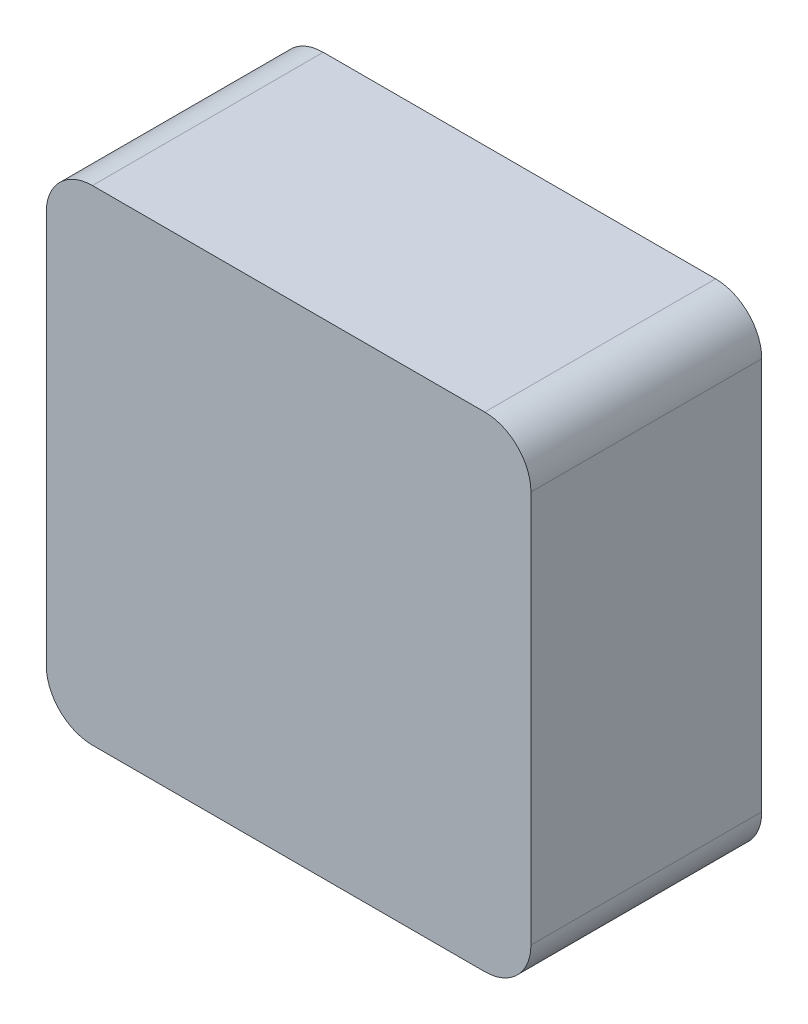
ISO-10303-21;
HEADER;
FILE_DESCRIPTION(('STEP AP214'),'2;1');
FILE_NAME('part.step','',(''),(''),'','','');
FILE_SCHEMA(('AUTOMOTIVE_DESIGN { 1 0 10303 214 1 1 1 1 }'));
ENDSEC;
DATA;
#1=APPLICATION_CONTEXT('core data for automotive mechanical design processes');
#2=APPLICATION_PROTOCOL_DEFINITION('international standard','automotive_design',2000,#1);
#3=PRODUCT_CONTEXT('',#1,'mechanical');
#4=PRODUCT('Part','Part','',(#3));
#5=PRODUCT_RELATED_PRODUCT_CATEGORY('part','',(#4));
#6=PRODUCT_DEFINITION_FORMATION('','',#4);
#7=PRODUCT_DEFINITION_CONTEXT('part definition',#1,'design');
#8=PRODUCT_DEFINITION('design','',#6,#7);
#9=PRODUCT_DEFINITION_SHAPE('','',#8);
#10=(LENGTH_UNIT() NAMED_UNIT(*) SI_UNIT(.MILLI.,.METRE.));
#11=(NAMED_UNIT(*) PLANE_ANGLE_UNIT() SI_UNIT($,.RADIAN.));
#12=(NAMED_UNIT(*) SI_UNIT($,.STERADIAN.) SOLID_ANGLE_UNIT());
#13=UNCERTAINTY_MEASURE_WITH_UNIT(LENGTH_MEASURE(1.E-05),#10,'distance_accuracy_value','');
#14=(GEOMETRIC_REPRESENTATION_CONTEXT(3) GLOBAL_UNCERTAINTY_ASSIGNED_CONTEXT((#13)) GLOBAL_UNIT_ASSIGNED_CONTEXT((#10,
#11,#12)) REPRESENTATION_CONTEXT('',''));
#15=CARTESIAN_POINT('',(0.,0.,0.));
#16=DIRECTION('',(0.,0.,1.));
#17=DIRECTION('',(1.,0.,0.));
#18=AXIS2_PLACEMENT_3D('',#15,#16,#17);
#19=CARTESIAN_POINT('',(0.,53.34,0.));
#20=DIRECTION('',(1.,0.,0.));
#21=DIRECTION('',(0.,0.,-1.));
#22=AXIS2_PLACEMENT_3D('',#19,#20,#21);
#23=PLANE('',#22);
#24=DIRECTION('',(0.,-1.,0.));
#25=VECTOR('',#24,1.);
#26=CARTESIAN_POINT('',(0.,53.34,0.));
#27=LINE('',#26,#25);
#28=CARTESIAN_POINT('',(0.,48.26,0.));
#29=VERTEX_POINT('',#28);
#30=CARTESIAN_POINT('',(0.,5.08,0.));
#31=VERTEX_POINT('',#30);
#32=EDGE_CURVE('E168',#29,#31,#27,.T.);
#33=ORIENTED_EDGE('',*,*,#32,.F.);
#34=DIRECTION('',(0.,0.,1.));
#35=VECTOR('',#34,1.);
#36=CARTESIAN_POINT('',(0.,48.26,0.));
#37=LINE('',#36,#35);
#38=CARTESIAN_POINT('',(0.,48.26,-25.4));
#39=VERTEX_POINT('',#38);
#40=EDGE_CURVE('E150',#29,#39,#37,.F.);
#41=ORIENTED_EDGE('',*,*,#40,.T.);
#42=DIRECTION('',(0.,-1.,0.));
#43=VECTOR('',#42,1.);
#44=CARTESIAN_POINT('',(0.,53.34,-25.4));
#45=LINE('',#44,#43);
#46=CARTESIAN_POINT('',(0.,5.08,-25.4));
#47=VERTEX_POINT('',#46);
#48=EDGE_CURVE('E175',#39,#47,#45,.T.);
#49=ORIENTED_EDGE('',*,*,#48,.T.);
#50=DIRECTION('',(0.,0.,1.));
#51=VECTOR('',#50,1.);
#52=CARTESIAN_POINT('',(0.,5.08,0.));
#53=LINE('',#52,#51);
#54=EDGE_CURVE('E214',#47,#31,#53,.T.);
#55=ORIENTED_EDGE('',*,*,#54,.T.);
#56=EDGE_LOOP('',(#33,#41,#49,#55));
#57=FACE_BOUND('',#56,.T.);
#58=ADVANCED_FACE('F33',(#57),#23,.F.);
#59=CARTESIAN_POINT('',(0.,53.34,0.));
#60=DIRECTION('',(0.,0.,-1.));
#61=DIRECTION('',(-1.,0.,0.));
#62=AXIS2_PLACEMENT_3D('',#59,#60,#61);
#63=PLANE('',#62);
#64=DIRECTION('',(0.,-1.,0.));
#65=VECTOR('',#64,1.);
#66=CARTESIAN_POINT('',(53.34,53.34,0.));
#67=LINE('',#66,#65);
#68=CARTESIAN_POINT('',(53.34,48.26,0.));
#69=VERTEX_POINT('',#68);
#70=CARTESIAN_POINT('',(53.34,5.08,0.));
#71=VERTEX_POINT('',#70);
#72=EDGE_CURVE('E192',#69,#71,#67,.T.);
#73=ORIENTED_EDGE('',*,*,#72,.F.);
#74=CARTESIAN_POINT('',(48.26,48.26,0.));
#75=DIRECTION('',(0.,0.,-1.));
#76=DIRECTION('',(-1.,0.,0.));
#77=AXIS2_PLACEMENT_3D('',#74,#75,#76);
#78=CIRCLE('',#77,5.08);
#79=CARTESIAN_POINT('',(48.26,53.34,0.));
#80=VERTEX_POINT('',#79);
#81=EDGE_CURVE('E155',#69,#80,#78,.F.);
#82=ORIENTED_EDGE('',*,*,#81,.T.);
#83=DIRECTION('',(1.,0.,0.));
#84=VECTOR('',#83,1.);
#85=CARTESIAN_POINT('',(0.,53.34,0.));
#86=LINE('',#85,#84);
#87=CARTESIAN_POINT('',(5.08,53.34,0.));
#88=VERTEX_POINT('',#87);
#89=EDGE_CURVE('E163',#88,#80,#86,.T.);
#90=ORIENTED_EDGE('',*,*,#89,.F.);
#91=CARTESIAN_POINT('',(5.08,48.26,0.));
#92=DIRECTION('',(0.,0.,-1.));
#93=DIRECTION('',(-1.,0.,0.));
#94=AXIS2_PLACEMENT_3D('',#91,#92,#93);
#95=CIRCLE('',#94,5.08);
#96=EDGE_CURVE('E145',#88,#29,#95,.F.);
#97=ORIENTED_EDGE('',*,*,#96,.T.);
#98=ORIENTED_EDGE('',*,*,#32,.T.);
#99=CARTESIAN_POINT('',(5.08,5.08,0.));
#100=DIRECTION('',(0.,0.,-1.));
#101=DIRECTION('',(-1.,0.,0.));
#102=AXIS2_PLACEMENT_3D('',#99,#100,#101);
#103=CIRCLE('',#102,5.08);
#104=CARTESIAN_POINT('',(5.08,0.,0.));
#105=VERTEX_POINT('',#104);
#106=EDGE_CURVE('E156',#31,#105,#103,.F.);
#107=ORIENTED_EDGE('',*,*,#106,.T.);
#108=DIRECTION('',(1.,0.,0.));
#109=VECTOR('',#108,1.);
#110=CARTESIAN_POINT('',(0.,0.,0.));
#111=LINE('',#110,#109);
#112=CARTESIAN_POINT('',(48.26,0.,0.));
#113=VERTEX_POINT('',#112);
#114=EDGE_CURVE('E178',#105,#113,#111,.T.);
#115=ORIENTED_EDGE('',*,*,#114,.T.);
#116=CARTESIAN_POINT('',(48.26,5.08,0.));
#117=DIRECTION('',(0.,0.,-1.));
#118=DIRECTION('',(-1.,0.,0.));
#119=AXIS2_PLACEMENT_3D('',#116,#117,#118);
#120=CIRCLE('',#119,5.08);
#121=EDGE_CURVE('E210',#113,#71,#120,.F.);
#122=ORIENTED_EDGE('',*,*,#121,.T.);
#123=EDGE_LOOP('',(#73,#82,#90,#97,#98,#107,#115,#122));
#124=FACE_BOUND('',#123,.T.);
#125=ADVANCED_FACE('F171',(#124),#63,.F.);
#126=CARTESIAN_POINT('',(53.34,53.34,0.));
#127=DIRECTION('',(-1.,0.,0.));
#128=DIRECTION('',(0.,0.,1.));
#129=AXIS2_PLACEMENT_3D('',#126,#127,#128);
#130=PLANE('',#129);
#131=DIRECTION('',(0.,-1.,0.));
#132=VECTOR('',#131,1.);
#133=CARTESIAN_POINT('',(53.34,53.34,-25.4));
#134=LINE('',#133,#132);
#135=CARTESIAN_POINT('',(53.34,48.26,-25.4));
#136=VERTEX_POINT('',#135);
#137=CARTESIAN_POINT('',(53.34,5.08,-25.4));
#138=VERTEX_POINT('',#137);
#139=EDGE_CURVE('E189',#136,#138,#134,.T.);
#140=ORIENTED_EDGE('',*,*,#139,.F.);
#141=DIRECTION('',(0.,0.,-1.));
#142=VECTOR('',#141,1.);
#143=CARTESIAN_POINT('',(53.34,48.26,0.));
#144=LINE('',#143,#142);
#145=EDGE_CURVE('E208',#136,#69,#144,.F.);
#146=ORIENTED_EDGE('',*,*,#145,.T.);
#147=ORIENTED_EDGE('',*,*,#72,.T.);
#148=DIRECTION('',(0.,0.,-1.));
#149=VECTOR('',#148,1.);
#150=CARTESIAN_POINT('',(53.34,5.08,-25.4));
#151=LINE('',#150,#149);
#152=EDGE_CURVE('E205',#71,#138,#151,.T.);
#153=ORIENTED_EDGE('',*,*,#152,.T.);
#154=EDGE_LOOP('',(#140,#146,#147,#153));
#155=FACE_BOUND('',#154,.T.);
#156=ADVANCED_FACE('F320',(#155),#130,.F.);
#157=CARTESIAN_POINT('',(0.,53.34,-25.4));
#158=DIRECTION('',(0.,0.,1.));
#159=DIRECTION('',(1.,0.,0.));
#160=AXIS2_PLACEMENT_3D('',#157,#158,#159);
#161=PLANE('',#160);
#162=DIRECTION('',(-1.,0.,0.));
#163=VECTOR('',#162,1.);
#164=CARTESIAN_POINT('',(46.99,6.35,-25.4));
#165=LINE('',#164,#163);
#166=CARTESIAN_POINT('',(41.91,6.35,-25.4));
#167=VERTEX_POINT('',#166);
#168=CARTESIAN_POINT('',(11.43,6.35,-25.4));
#169=VERTEX_POINT('',#168);
#170=EDGE_CURVE('E258',#167,#169,#165,.T.);
#171=ORIENTED_EDGE('',*,*,#170,.F.);
#172=CARTESIAN_POINT('',(41.91,11.43,-25.4));
#173=DIRECTION('',(0.,0.,1.));
#174=DIRECTION('',(1.,0.,0.));
#175=AXIS2_PLACEMENT_3D('',#172,#173,#174);
#176=CIRCLE('',#175,5.08);
#177=CARTESIAN_POINT('',(46.99,11.43,-25.4));
#178=VERTEX_POINT('',#177);
#179=EDGE_CURVE('E251',#167,#178,#176,.T.);
#180=ORIENTED_EDGE('',*,*,#179,.T.);
#181=DIRECTION('',(0.,-1.,0.));
#182=VECTOR('',#181,1.);
#183=CARTESIAN_POINT('',(46.99,46.99,-25.4));
#184=LINE('',#183,#182);
#185=CARTESIAN_POINT('',(46.99,41.91,-25.4));
#186=VERTEX_POINT('',#185);
#187=EDGE_CURVE('E256',#186,#178,#184,.T.);
#188=ORIENTED_EDGE('',*,*,#187,.F.);
#189=CARTESIAN_POINT('',(41.91,41.91,-25.4));
#190=DIRECTION('',(0.,0.,1.));
#191=DIRECTION('',(1.,0.,0.));
#192=AXIS2_PLACEMENT_3D('',#189,#190,#191);
#193=CIRCLE('',#192,5.08);
#194=CARTESIAN_POINT('',(41.91,46.99,-25.4));
#195=VERTEX_POINT('',#194);
#196=EDGE_CURVE('E41',#186,#195,#193,.T.);
#197=ORIENTED_EDGE('',*,*,#196,.T.);
#198=DIRECTION('',(1.,0.,0.));
#199=VECTOR('',#198,1.);
#200=CARTESIAN_POINT('',(46.99,46.99,-25.4));
#201=LINE('',#200,#199);
#202=CARTESIAN_POINT('',(11.43,46.99,-25.4));
#203=VERTEX_POINT('',#202);
#204=EDGE_CURVE('E181',#203,#195,#201,.T.);
#205=ORIENTED_EDGE('',*,*,#204,.F.);
#206=CARTESIAN_POINT('',(11.43,41.91,-25.4));
#207=DIRECTION('',(0.,0.,1.));
#208=DIRECTION('',(1.,0.,0.));
#209=AXIS2_PLACEMENT_3D('',#206,#207,#208);
#210=CIRCLE('',#209,5.08);
#211=CARTESIAN_POINT('',(6.35,41.91,-25.4));
#212=VERTEX_POINT('',#211);
#213=EDGE_CURVE('E11',#203,#212,#210,.T.);
#214=ORIENTED_EDGE('',*,*,#213,.T.);
#215=DIRECTION('',(0.,1.,0.));
#216=VECTOR('',#215,1.);
#217=CARTESIAN_POINT('',(6.35,46.99,-25.4));
#218=LINE('',#217,#216);
#219=CARTESIAN_POINT('',(6.35,11.43,-25.4));
#220=VERTEX_POINT('',#219);
#221=EDGE_CURVE('E288',#220,#212,#218,.T.);
#222=ORIENTED_EDGE('',*,*,#221,.F.);
#223=CARTESIAN_POINT('',(11.43,11.43,-25.4));
#224=DIRECTION('',(0.,0.,1.));
#225=DIRECTION('',(1.,0.,0.));
#226=AXIS2_PLACEMENT_3D('',#223,#224,#225);
#227=CIRCLE('',#226,5.08);
#228=EDGE_CURVE('E249',#220,#169,#227,.T.);
#229=ORIENTED_EDGE('',*,*,#228,.T.);
#230=EDGE_LOOP('',(#171,#180,#188,#197,#205,#214,#222,#229));
#231=FACE_BOUND('',#230,.T.);
#232=DIRECTION('',(-1.,0.,0.));
#233=VECTOR('',#232,1.);
#234=CARTESIAN_POINT('',(0.,53.34,-25.4));
#235=LINE('',#234,#233);
#236=CARTESIAN_POINT('',(48.26,53.34,-25.4));
#237=VERTEX_POINT('',#236);
#238=CARTESIAN_POINT('',(5.08,53.34,-25.4));
#239=VERTEX_POINT('',#238);
#240=EDGE_CURVE('E166',#237,#239,#235,.T.);
#241=ORIENTED_EDGE('',*,*,#240,.F.);
#242=CARTESIAN_POINT('',(48.26,48.26,-25.4));
#243=DIRECTION('',(0.,0.,1.));
#244=DIRECTION('',(1.,0.,0.));
#245=AXIS2_PLACEMENT_3D('',#242,#243,#244);
#246=CIRCLE('',#245,5.08);
#247=EDGE_CURVE('E203',#237,#136,#246,.F.);
#248=ORIENTED_EDGE('',*,*,#247,.T.);
#249=ORIENTED_EDGE('',*,*,#139,.T.);
#250=CARTESIAN_POINT('',(48.26,5.08,-25.4));
#251=DIRECTION('',(0.,0.,1.));
#252=DIRECTION('',(1.,0.,0.));
#253=AXIS2_PLACEMENT_3D('',#250,#251,#252);
#254=CIRCLE('',#253,5.08);
#255=CARTESIAN_POINT('',(48.26,0.,-25.4));
#256=VERTEX_POINT('',#255);
#257=EDGE_CURVE('E197',#138,#256,#254,.F.);
#258=ORIENTED_EDGE('',*,*,#257,.T.);
#259=DIRECTION('',(-1.,0.,0.));
#260=VECTOR('',#259,1.);
#261=CARTESIAN_POINT('',(0.,0.,-25.4));
#262=LINE('',#261,#260);
#263=CARTESIAN_POINT('',(5.08,0.,-25.4));
#264=VERTEX_POINT('',#263);
#265=EDGE_CURVE('E173',#256,#264,#262,.T.);
#266=ORIENTED_EDGE('',*,*,#265,.T.);
#267=CARTESIAN_POINT('',(5.08,5.08,-25.4));
#268=DIRECTION('',(0.,0.,1.));
#269=DIRECTION('',(1.,0.,0.));
#270=AXIS2_PLACEMENT_3D('',#267,#268,#269);
#271=CIRCLE('',#270,5.08);
#272=EDGE_CURVE('E199',#264,#47,#271,.F.);
#273=ORIENTED_EDGE('',*,*,#272,.T.);
#274=ORIENTED_EDGE('',*,*,#48,.F.);
#275=CARTESIAN_POINT('',(5.08,48.26,-25.4));
#276=DIRECTION('',(0.,0.,1.));
#277=DIRECTION('',(1.,0.,0.));
#278=AXIS2_PLACEMENT_3D('',#275,#276,#277);
#279=CIRCLE('',#278,5.08);
#280=EDGE_CURVE('E201',#39,#239,#279,.F.);
#281=ORIENTED_EDGE('',*,*,#280,.T.);
#282=EDGE_LOOP('',(#241,#248,#249,#258,#266,#273,#274,#281));
#283=FACE_BOUND('',#282,.T.);
#284=ADVANCED_FACE('F254',(#231,#283),#161,.F.);
#285=CARTESIAN_POINT('',(0.,53.34,0.));
#286=DIRECTION('',(0.,-1.,0.));
#287=DIRECTION('',(0.,0.,-1.));
#288=AXIS2_PLACEMENT_3D('',#285,#286,#287);
#289=PLANE('',#288);
#290=ORIENTED_EDGE('',*,*,#89,.T.);
#291=DIRECTION('',(0.,0.,-1.));
#292=VECTOR('',#291,1.);
#293=CARTESIAN_POINT('',(48.26,53.34,0.));
#294=LINE('',#293,#292);
#295=EDGE_CURVE('E167',#80,#237,#294,.T.);
#296=ORIENTED_EDGE('',*,*,#295,.T.);
#297=ORIENTED_EDGE('',*,*,#240,.T.);
#298=DIRECTION('',(0.,0.,1.));
#299=VECTOR('',#298,1.);
#300=CARTESIAN_POINT('',(5.08,53.34,0.));
#301=LINE('',#300,#299);
#302=EDGE_CURVE('E149',#239,#88,#301,.T.);
#303=ORIENTED_EDGE('',*,*,#302,.T.);
#304=EDGE_LOOP('',(#290,#296,#297,#303));
#305=FACE_BOUND('',#304,.T.);
#306=ADVANCED_FACE('F161',(#305),#289,.F.);
#307=CARTESIAN_POINT('',(0.,0.,0.));
#308=DIRECTION('',(0.,-1.,0.));
#309=DIRECTION('',(0.,0.,-1.));
#310=AXIS2_PLACEMENT_3D('',#307,#308,#309);
#311=PLANE('',#310);
#312=ORIENTED_EDGE('',*,*,#114,.F.);
#313=DIRECTION('',(0.,0.,1.));
#314=VECTOR('',#313,1.);
#315=CARTESIAN_POINT('',(5.08,0.,-25.4));
#316=LINE('',#315,#314);
#317=EDGE_CURVE('E220',#105,#264,#316,.F.);
#318=ORIENTED_EDGE('',*,*,#317,.T.);
#319=ORIENTED_EDGE('',*,*,#265,.F.);
#320=DIRECTION('',(0.,0.,-1.));
#321=VECTOR('',#320,1.);
#322=CARTESIAN_POINT('',(48.26,0.,0.));
#323=LINE('',#322,#321);
#324=EDGE_CURVE('E218',#256,#113,#323,.F.);
#325=ORIENTED_EDGE('',*,*,#324,.T.);
#326=EDGE_LOOP('',(#312,#318,#319,#325));
#327=FACE_BOUND('',#326,.T.);
#328=ADVANCED_FACE('F327',(#327),#311,.T.);
#329=CARTESIAN_POINT('',(48.26,48.26,0.));
#330=DIRECTION('',(0.,0.,-1.));
#331=DIRECTION('',(-1.,0.,0.));
#332=AXIS2_PLACEMENT_3D('',#329,#330,#331);
#333=CYLINDRICAL_SURFACE('',#332,5.08);
#334=ORIENTED_EDGE('',*,*,#81,.F.);
#335=ORIENTED_EDGE('',*,*,#145,.F.);
#336=ORIENTED_EDGE('',*,*,#247,.F.);
#337=ORIENTED_EDGE('',*,*,#295,.F.);
#338=EDGE_LOOP('',(#334,#335,#336,#337));
#339=FACE_BOUND('',#338,.T.);
#340=ADVANCED_FACE('F324',(#339),#333,.T.);
#341=CARTESIAN_POINT('',(5.08,48.26,0.));
#342=DIRECTION('',(0.,0.,1.));
#343=DIRECTION('',(1.,0.,0.));
#344=AXIS2_PLACEMENT_3D('',#341,#342,#343);
#345=CYLINDRICAL_SURFACE('',#344,5.08);
#346=ORIENTED_EDGE('',*,*,#280,.F.);
#347=ORIENTED_EDGE('',*,*,#40,.F.);
#348=ORIENTED_EDGE('',*,*,#96,.F.);
#349=ORIENTED_EDGE('',*,*,#302,.F.);
#350=EDGE_LOOP('',(#346,#347,#348,#349));
#351=FACE_BOUND('',#350,.T.);
#352=ADVANCED_FACE('F148',(#351),#345,.T.);
#353=CARTESIAN_POINT('',(5.08,5.08,0.));
#354=DIRECTION('',(0.,0.,-1.));
#355=DIRECTION('',(-1.,0.,0.));
#356=AXIS2_PLACEMENT_3D('',#353,#354,#355);
#357=CYLINDRICAL_SURFACE('',#356,5.08);
#358=ORIENTED_EDGE('',*,*,#272,.F.);
#359=ORIENTED_EDGE('',*,*,#317,.F.);
#360=ORIENTED_EDGE('',*,*,#106,.F.);
#361=ORIENTED_EDGE('',*,*,#54,.F.);
#362=EDGE_LOOP('',(#358,#359,#360,#361));
#363=FACE_BOUND('',#362,.T.);
#364=ADVANCED_FACE('F331',(#363),#357,.T.);
#365=CARTESIAN_POINT('',(48.26,5.08,0.));
#366=DIRECTION('',(0.,0.,1.));
#367=DIRECTION('',(1.,0.,0.));
#368=AXIS2_PLACEMENT_3D('',#365,#366,#367);
#369=CYLINDRICAL_SURFACE('',#368,5.08);
#370=ORIENTED_EDGE('',*,*,#121,.F.);
#371=ORIENTED_EDGE('',*,*,#324,.F.);
#372=ORIENTED_EDGE('',*,*,#257,.F.);
#373=ORIENTED_EDGE('',*,*,#152,.F.);
#374=EDGE_LOOP('',(#370,#371,#372,#373));
#375=FACE_BOUND('',#374,.T.);
#376=ADVANCED_FACE('F333',(#375),#369,.T.);
#377=CARTESIAN_POINT('',(46.99,46.99,-7.62));
#378=DIRECTION('',(1.,0.,0.));
#379=DIRECTION('',(0.,1.,0.));
#380=AXIS2_PLACEMENT_3D('',#377,#378,#379);
#381=PLANE('',#380);
#382=ORIENTED_EDGE('',*,*,#187,.T.);
#383=DIRECTION('',(0.,0.,-1.));
#384=VECTOR('',#383,1.);
#385=CARTESIAN_POINT('',(46.99,11.43,-7.62));
#386=LINE('',#385,#384);
#387=CARTESIAN_POINT('',(46.99,11.43,-7.62));
#388=VERTEX_POINT('',#387);
#389=EDGE_CURVE('E243',#178,#388,#386,.F.);
#390=ORIENTED_EDGE('',*,*,#389,.T.);
#391=DIRECTION('',(0.,-1.,0.));
#392=VECTOR('',#391,1.);
#393=CARTESIAN_POINT('',(46.99,46.99,-7.62));
#394=LINE('',#393,#392);
#395=CARTESIAN_POINT('',(46.99,41.91,-7.62));
#396=VERTEX_POINT('',#395);
#397=EDGE_CURVE('E276',#396,#388,#394,.T.);
#398=ORIENTED_EDGE('',*,*,#397,.F.);
#399=DIRECTION('',(0.,0.,-1.));
#400=VECTOR('',#399,1.);
#401=CARTESIAN_POINT('',(46.99,41.91,-25.4));
#402=LINE('',#401,#400);
#403=EDGE_CURVE('E240',#396,#186,#402,.T.);
#404=ORIENTED_EDGE('',*,*,#403,.T.);
#405=EDGE_LOOP('',(#382,#390,#398,#404));
#406=FACE_BOUND('',#405,.T.);
#407=ADVANCED_FACE('F263',(#406),#381,.F.);
#408=CARTESIAN_POINT('',(46.99,46.99,-7.62));
#409=DIRECTION('',(0.,1.,0.));
#410=DIRECTION('',(-1.,0.,0.));
#411=AXIS2_PLACEMENT_3D('',#408,#409,#410);
#412=PLANE('',#411);
#413=ORIENTED_EDGE('',*,*,#204,.T.);
#414=DIRECTION('',(0.,0.,-1.));
#415=VECTOR('',#414,1.);
#416=CARTESIAN_POINT('',(41.91,46.99,-7.62));
#417=LINE('',#416,#415);
#418=CARTESIAN_POINT('',(41.91,46.99,-7.62));
#419=VERTEX_POINT('',#418);
#420=EDGE_CURVE('E247',#195,#419,#417,.F.);
#421=ORIENTED_EDGE('',*,*,#420,.T.);
#422=DIRECTION('',(1.,0.,0.));
#423=VECTOR('',#422,1.);
#424=CARTESIAN_POINT('',(46.99,46.99,-7.62));
#425=LINE('',#424,#423);
#426=CARTESIAN_POINT('',(11.43,46.99,-7.62));
#427=VERTEX_POINT('',#426);
#428=EDGE_CURVE('E185',#427,#419,#425,.T.);
#429=ORIENTED_EDGE('',*,*,#428,.F.);
#430=DIRECTION('',(0.,0.,-1.));
#431=VECTOR('',#430,1.);
#432=CARTESIAN_POINT('',(11.43,46.99,-25.4));
#433=LINE('',#432,#431);
#434=EDGE_CURVE('E245',#427,#203,#433,.T.);
#435=ORIENTED_EDGE('',*,*,#434,.T.);
#436=EDGE_LOOP('',(#413,#421,#429,#435));
#437=FACE_BOUND('',#436,.T.);
#438=ADVANCED_FACE('F294',(#437),#412,.F.);
#439=CARTESIAN_POINT('',(6.35,46.99,-7.62));
#440=DIRECTION('',(-1.,0.,0.));
#441=DIRECTION('',(0.,-1.,0.));
#442=AXIS2_PLACEMENT_3D('',#439,#440,#441);
#443=PLANE('',#442);
#444=DIRECTION('',(0.,1.,0.));
#445=VECTOR('',#444,1.);
#446=CARTESIAN_POINT('',(6.35,46.99,-7.62));
#447=LINE('',#446,#445);
#448=CARTESIAN_POINT('',(6.35,11.43,-7.62));
#449=VERTEX_POINT('',#448);
#450=CARTESIAN_POINT('',(6.35,41.91,-7.62));
#451=VERTEX_POINT('',#450);
#452=EDGE_CURVE('E280',#449,#451,#447,.T.);
#453=ORIENTED_EDGE('',*,*,#452,.F.);
#454=DIRECTION('',(0.,0.,-1.));
#455=VECTOR('',#454,1.);
#456=CARTESIAN_POINT('',(6.35,11.43,-25.4));
#457=LINE('',#456,#455);
#458=EDGE_CURVE('E224',#449,#220,#457,.T.);
#459=ORIENTED_EDGE('',*,*,#458,.T.);
#460=ORIENTED_EDGE('',*,*,#221,.T.);
#461=DIRECTION('',(0.,0.,-1.));
#462=VECTOR('',#461,1.);
#463=CARTESIAN_POINT('',(6.35,41.91,-7.62));
#464=LINE('',#463,#462);
#465=EDGE_CURVE('E222',#212,#451,#464,.F.);
#466=ORIENTED_EDGE('',*,*,#465,.T.);
#467=EDGE_LOOP('',(#453,#459,#460,#466));
#468=FACE_BOUND('',#467,.T.);
#469=ADVANCED_FACE('F301',(#468),#443,.F.);
#470=CARTESIAN_POINT('',(46.99,6.35,-7.62));
#471=DIRECTION('',(0.,-1.,0.));
#472=DIRECTION('',(0.,0.,-1.));
#473=AXIS2_PLACEMENT_3D('',#470,#471,#472);
#474=PLANE('',#473);
#475=ORIENTED_EDGE('',*,*,#170,.T.);
#476=DIRECTION('',(0.,0.,-1.));
#477=VECTOR('',#476,1.);
#478=CARTESIAN_POINT('',(11.43,6.35,-7.62));
#479=LINE('',#478,#477);
#480=CARTESIAN_POINT('',(11.43,6.35,-7.62));
#481=VERTEX_POINT('',#480);
#482=EDGE_CURVE('E230',#169,#481,#479,.F.);
#483=ORIENTED_EDGE('',*,*,#482,.T.);
#484=DIRECTION('',(-1.,0.,0.));
#485=VECTOR('',#484,1.);
#486=CARTESIAN_POINT('',(46.99,6.35,-7.62));
#487=LINE('',#486,#485);
#488=CARTESIAN_POINT('',(41.91,6.35,-7.62));
#489=VERTEX_POINT('',#488);
#490=EDGE_CURVE('E274',#489,#481,#487,.T.);
#491=ORIENTED_EDGE('',*,*,#490,.F.);
#492=DIRECTION('',(0.,0.,-1.));
#493=VECTOR('',#492,1.);
#494=CARTESIAN_POINT('',(41.91,6.35,-25.4));
#495=LINE('',#494,#493);
#496=EDGE_CURVE('E227',#489,#167,#495,.T.);
#497=ORIENTED_EDGE('',*,*,#496,.T.);
#498=EDGE_LOOP('',(#475,#483,#491,#497));
#499=FACE_BOUND('',#498,.T.);
#500=ADVANCED_FACE('F278',(#499),#474,.F.);
#501=CARTESIAN_POINT('',(0.,0.,-7.62));
#502=DIRECTION('',(0.,0.,-1.));
#503=DIRECTION('',(-1.,0.,0.));
#504=AXIS2_PLACEMENT_3D('',#501,#502,#503);
#505=PLANE('',#504);
#506=ORIENTED_EDGE('',*,*,#490,.T.);
#507=CARTESIAN_POINT('',(11.43,11.43,-7.62));
#508=DIRECTION('',(0.,0.,-1.));
#509=DIRECTION('',(-1.,0.,0.));
#510=AXIS2_PLACEMENT_3D('',#507,#508,#509);
#511=CIRCLE('',#510,5.08);
#512=EDGE_CURVE('E238',#481,#449,#511,.T.);
#513=ORIENTED_EDGE('',*,*,#512,.T.);
#514=ORIENTED_EDGE('',*,*,#452,.T.);
#515=CARTESIAN_POINT('',(11.43,41.91,-7.62));
#516=DIRECTION('',(0.,0.,-1.));
#517=DIRECTION('',(-1.,0.,0.));
#518=AXIS2_PLACEMENT_3D('',#515,#516,#517);
#519=CIRCLE('',#518,5.08);
#520=EDGE_CURVE('E232',#451,#427,#519,.T.);
#521=ORIENTED_EDGE('',*,*,#520,.T.);
#522=ORIENTED_EDGE('',*,*,#428,.T.);
#523=CARTESIAN_POINT('',(41.91,41.91,-7.62));
#524=DIRECTION('',(0.,0.,-1.));
#525=DIRECTION('',(-1.,0.,0.));
#526=AXIS2_PLACEMENT_3D('',#523,#524,#525);
#527=CIRCLE('',#526,5.08);
#528=EDGE_CURVE('E234',#419,#396,#527,.T.);
#529=ORIENTED_EDGE('',*,*,#528,.T.);
#530=ORIENTED_EDGE('',*,*,#397,.T.);
#531=CARTESIAN_POINT('',(41.91,11.43,-7.62));
#532=DIRECTION('',(0.,0.,-1.));
#533=DIRECTION('',(-1.,0.,0.));
#534=AXIS2_PLACEMENT_3D('',#531,#532,#533);
#535=CIRCLE('',#534,5.08);
#536=EDGE_CURVE('E236',#388,#489,#535,.T.);
#537=ORIENTED_EDGE('',*,*,#536,.T.);
#538=EDGE_LOOP('',(#506,#513,#514,#521,#522,#529,#530,#537));
#539=FACE_BOUND('',#538,.T.);
#540=ADVANCED_FACE('F273',(#539),#505,.T.);
#541=CARTESIAN_POINT('',(11.43,11.43,-7.62));
#542=DIRECTION('',(0.,0.,1.));
#543=DIRECTION('',(1.,0.,0.));
#544=AXIS2_PLACEMENT_3D('',#541,#542,#543);
#545=CYLINDRICAL_SURFACE('',#544,5.08);
#546=ORIENTED_EDGE('',*,*,#512,.F.);
#547=ORIENTED_EDGE('',*,*,#482,.F.);
#548=ORIENTED_EDGE('',*,*,#228,.F.);
#549=ORIENTED_EDGE('',*,*,#458,.F.);
#550=EDGE_LOOP('',(#546,#547,#548,#549));
#551=FACE_BOUND('',#550,.T.);
#552=ADVANCED_FACE('F304',(#551),#545,.F.);
#553=CARTESIAN_POINT('',(41.91,11.43,-7.62));
#554=DIRECTION('',(0.,0.,1.));
#555=DIRECTION('',(1.,0.,0.));
#556=AXIS2_PLACEMENT_3D('',#553,#554,#555);
#557=CYLINDRICAL_SURFACE('',#556,5.08);
#558=ORIENTED_EDGE('',*,*,#536,.F.);
#559=ORIENTED_EDGE('',*,*,#389,.F.);
#560=ORIENTED_EDGE('',*,*,#179,.F.);
#561=ORIENTED_EDGE('',*,*,#496,.F.);
#562=EDGE_LOOP('',(#558,#559,#560,#561));
#563=FACE_BOUND('',#562,.T.);
#564=ADVANCED_FACE('F269',(#563),#557,.F.);
#565=CARTESIAN_POINT('',(41.91,41.91,-7.62));
#566=DIRECTION('',(0.,0.,1.));
#567=DIRECTION('',(1.,0.,0.));
#568=AXIS2_PLACEMENT_3D('',#565,#566,#567);
#569=CYLINDRICAL_SURFACE('',#568,5.08);
#570=ORIENTED_EDGE('',*,*,#528,.F.);
#571=ORIENTED_EDGE('',*,*,#420,.F.);
#572=ORIENTED_EDGE('',*,*,#196,.F.);
#573=ORIENTED_EDGE('',*,*,#403,.F.);
#574=EDGE_LOOP('',(#570,#571,#572,#573));
#575=FACE_BOUND('',#574,.T.);
#576=ADVANCED_FACE('F298',(#575),#569,.F.);
#577=CARTESIAN_POINT('',(11.43,41.91,-7.62));
#578=DIRECTION('',(0.,0.,1.));
#579=DIRECTION('',(1.,0.,0.));
#580=AXIS2_PLACEMENT_3D('',#577,#578,#579);
#581=CYLINDRICAL_SURFACE('',#580,5.08);
#582=ORIENTED_EDGE('',*,*,#520,.F.);
#583=ORIENTED_EDGE('',*,*,#465,.F.);
#584=ORIENTED_EDGE('',*,*,#213,.F.);
#585=ORIENTED_EDGE('',*,*,#434,.F.);
#586=EDGE_LOOP('',(#582,#583,#584,#585));
#587=FACE_BOUND('',#586,.T.);
#588=ADVANCED_FACE('F35',(#587),#581,.F.);
#589=CLOSED_SHELL('',(#58,#125,#156,#284,#306,#328,#340,#352,#364,#376,#407,#438,#469,#500,#540,
#552,#564,#576,#588));
#590=MANIFOLD_SOLID_BREP('B2',#589);
#591=ADVANCED_BREP_SHAPE_REPRESENTATION('',(#18,#590),#14);
#592=SHAPE_DEFINITION_REPRESENTATION(#9,#591);
ENDSEC;
END-ISO-10303-21;
